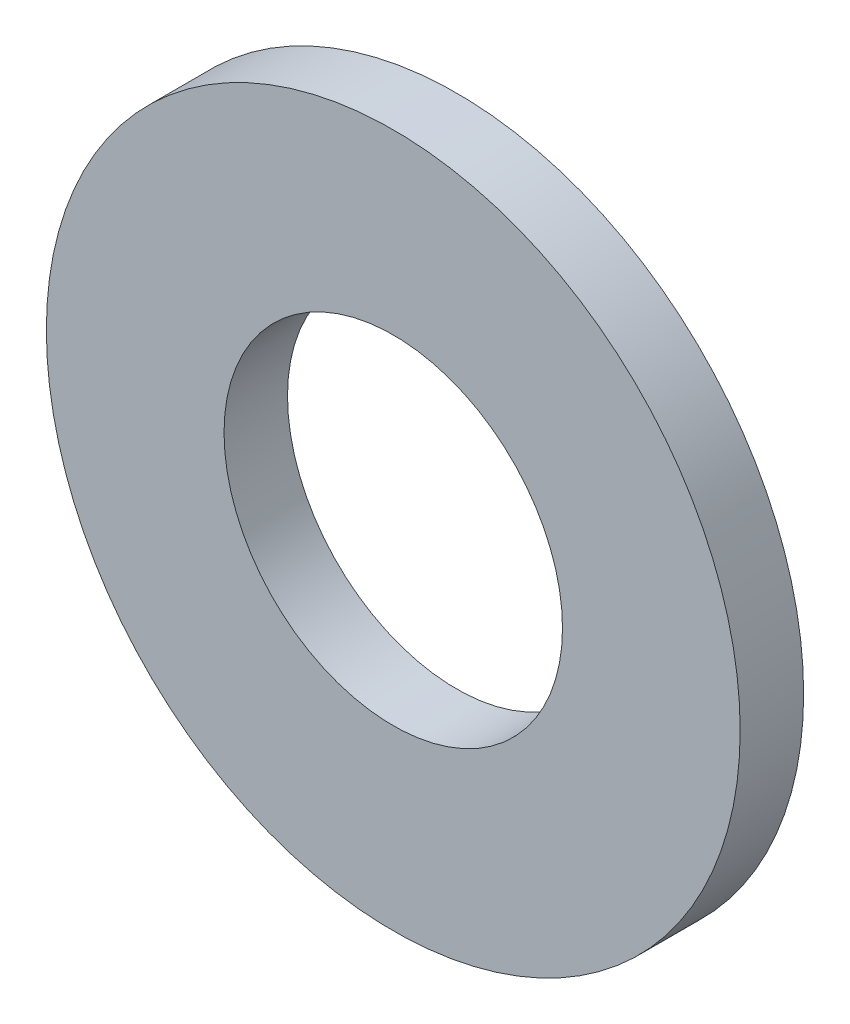
ISO-10303-21;
HEADER;
FILE_DESCRIPTION(('STEP AP214'),'2;1');
FILE_NAME('part.step','',(''),(''),'','','');
FILE_SCHEMA(('AUTOMOTIVE_DESIGN { 1 0 10303 214 1 1 1 1 }'));
ENDSEC;
DATA;
#1=APPLICATION_CONTEXT('core data for automotive mechanical design processes');
#2=APPLICATION_PROTOCOL_DEFINITION('international standard','automotive_design',2000,#1);
#3=PRODUCT_CONTEXT('',#1,'mechanical');
#4=PRODUCT('Part','Part','',(#3));
#5=PRODUCT_RELATED_PRODUCT_CATEGORY('part','',(#4));
#6=PRODUCT_DEFINITION_FORMATION('','',#4);
#7=PRODUCT_DEFINITION_CONTEXT('part definition',#1,'design');
#8=PRODUCT_DEFINITION('design','',#6,#7);
#9=PRODUCT_DEFINITION_SHAPE('','',#8);
#10=(LENGTH_UNIT() NAMED_UNIT(*) SI_UNIT(.MILLI.,.METRE.));
#11=(NAMED_UNIT(*) PLANE_ANGLE_UNIT() SI_UNIT($,.RADIAN.));
#12=(NAMED_UNIT(*) SI_UNIT($,.STERADIAN.) SOLID_ANGLE_UNIT());
#13=UNCERTAINTY_MEASURE_WITH_UNIT(LENGTH_MEASURE(1.E-05),#10,'distance_accuracy_value','');
#14=(GEOMETRIC_REPRESENTATION_CONTEXT(3) GLOBAL_UNCERTAINTY_ASSIGNED_CONTEXT((#13)) GLOBAL_UNIT_ASSIGNED_CONTEXT((#10,
#11,#12)) REPRESENTATION_CONTEXT('',''));
#15=CARTESIAN_POINT('',(0.,0.,0.));
#16=DIRECTION('',(0.,0.,1.));
#17=DIRECTION('',(1.,0.,0.));
#18=AXIS2_PLACEMENT_3D('',#15,#16,#17);
#19=CARTESIAN_POINT('',(0.,0.,1.905));
#20=DIRECTION('',(0.,0.,1.));
#21=DIRECTION('',(1.,0.,0.));
#22=AXIS2_PLACEMENT_3D('',#19,#20,#21);
#23=PLANE('',#22);
#24=CARTESIAN_POINT('',(0.,0.,1.905));
#25=DIRECTION('',(0.,0.,1.));
#26=DIRECTION('',(1.,0.,0.));
#27=AXIS2_PLACEMENT_3D('',#24,#25,#26);
#28=CIRCLE('',#27,10.414);
#29=CARTESIAN_POINT('',(10.414,0.,1.905));
#30=VERTEX_POINT('',#29);
#31=EDGE_CURVE('E10',#30,#30,#28,.T.);
#32=ORIENTED_EDGE('',*,*,#31,.T.);
#33=EDGE_LOOP('',(#32));
#34=FACE_BOUND('',#33,.T.);
#35=CARTESIAN_POINT('',(0.,0.,1.905));
#36=DIRECTION('',(0.,0.,1.));
#37=DIRECTION('',(1.,0.,0.));
#38=AXIS2_PLACEMENT_3D('',#35,#36,#37);
#39=CIRCLE('',#38,5.08);
#40=CARTESIAN_POINT('',(5.08,0.,1.905));
#41=VERTEX_POINT('',#40);
#42=EDGE_CURVE('E42',#41,#41,#39,.T.);
#43=ORIENTED_EDGE('',*,*,#42,.F.);
#44=EDGE_LOOP('',(#43));
#45=FACE_BOUND('',#44,.T.);
#46=ADVANCED_FACE('F31',(#34,#45),#23,.T.);
#47=CARTESIAN_POINT('',(0.,0.,0.));
#48=DIRECTION('',(0.,0.,1.));
#49=DIRECTION('',(1.,0.,0.));
#50=AXIS2_PLACEMENT_3D('',#47,#48,#49);
#51=PLANE('',#50);
#52=CARTESIAN_POINT('',(0.,0.,0.));
#53=DIRECTION('',(0.,0.,1.));
#54=DIRECTION('',(1.,0.,0.));
#55=AXIS2_PLACEMENT_3D('',#52,#53,#54);
#56=CIRCLE('',#55,10.414);
#57=CARTESIAN_POINT('',(10.414,0.,0.));
#58=VERTEX_POINT('',#57);
#59=EDGE_CURVE('E35',#58,#58,#56,.T.);
#60=ORIENTED_EDGE('',*,*,#59,.F.);
#61=EDGE_LOOP('',(#60));
#62=FACE_BOUND('',#61,.T.);
#63=CARTESIAN_POINT('',(0.,0.,0.));
#64=DIRECTION('',(0.,0.,1.));
#65=DIRECTION('',(1.,0.,0.));
#66=AXIS2_PLACEMENT_3D('',#63,#64,#65);
#67=CIRCLE('',#66,5.08);
#68=CARTESIAN_POINT('',(5.08,0.,0.));
#69=VERTEX_POINT('',#68);
#70=EDGE_CURVE('E44',#69,#69,#67,.T.);
#71=ORIENTED_EDGE('',*,*,#70,.T.);
#72=EDGE_LOOP('',(#71));
#73=FACE_BOUND('',#72,.T.);
#74=ADVANCED_FACE('F54',(#62,#73),#51,.F.);
#75=CARTESIAN_POINT('',(0.,0.,1.905));
#76=DIRECTION('',(0.,0.,-1.));
#77=DIRECTION('',(-1.,0.,0.));
#78=AXIS2_PLACEMENT_3D('',#75,#76,#77);
#79=CYLINDRICAL_SURFACE('',#78,10.414);
#80=ORIENTED_EDGE('',*,*,#31,.F.);
#81=EDGE_LOOP('',(#80));
#82=FACE_BOUND('',#81,.T.);
#83=ORIENTED_EDGE('',*,*,#59,.T.);
#84=EDGE_LOOP('',(#83));
#85=FACE_BOUND('',#84,.T.);
#86=ADVANCED_FACE('F33',(#82,#85),#79,.T.);
#87=CARTESIAN_POINT('',(0.,0.,1.905));
#88=DIRECTION('',(0.,0.,-1.));
#89=DIRECTION('',(-1.,0.,0.));
#90=AXIS2_PLACEMENT_3D('',#87,#88,#89);
#91=CYLINDRICAL_SURFACE('',#90,5.08);
#92=ORIENTED_EDGE('',*,*,#42,.T.);
#93=EDGE_LOOP('',(#92));
#94=FACE_BOUND('',#93,.T.);
#95=ORIENTED_EDGE('',*,*,#70,.F.);
#96=EDGE_LOOP('',(#95));
#97=FACE_BOUND('',#96,.T.);
#98=ADVANCED_FACE('F50',(#94,#97),#91,.F.);
#99=CLOSED_SHELL('',(#46,#74,#86,#98));
#100=MANIFOLD_SOLID_BREP('B2',#99);
#101=ADVANCED_BREP_SHAPE_REPRESENTATION('',(#18,#100),#14);
#102=SHAPE_DEFINITION_REPRESENTATION(#9,#101);
ENDSEC;
END-ISO-10303-21;
